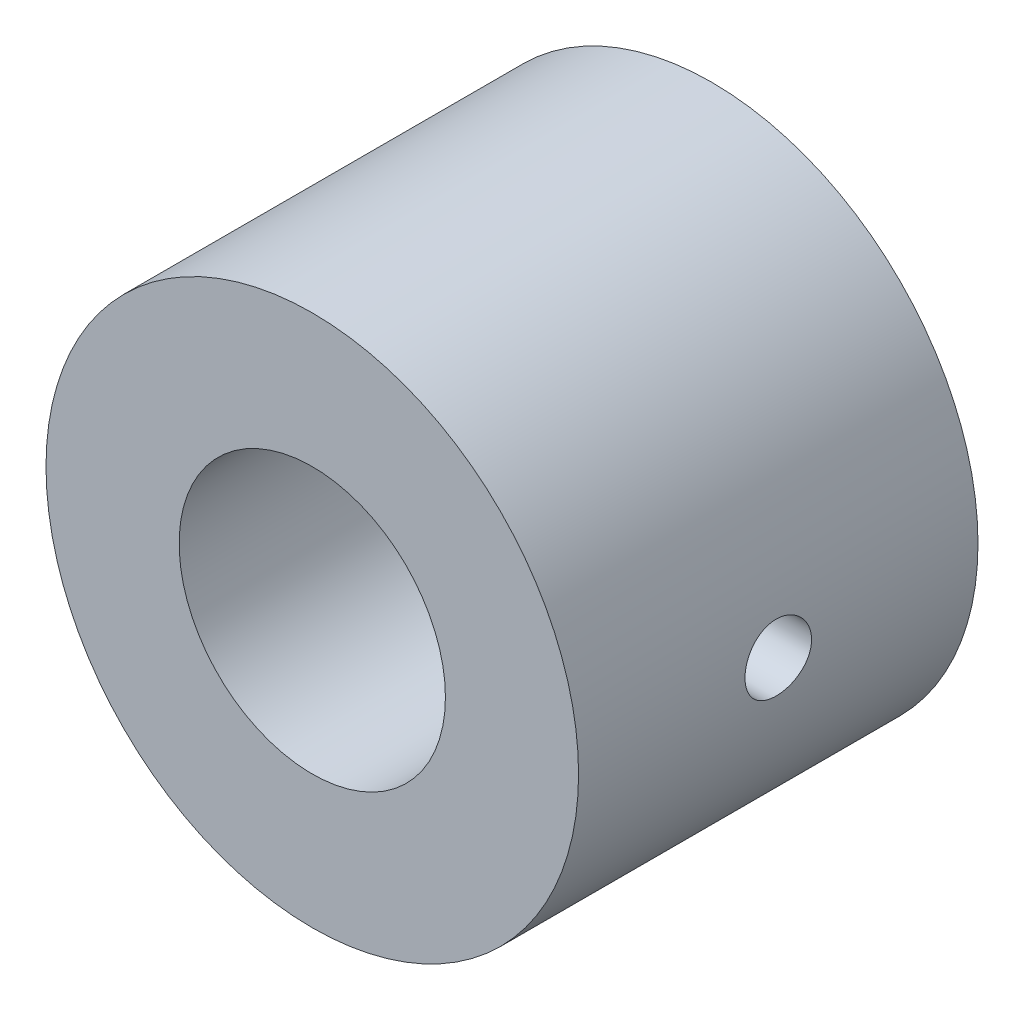
ISO-10303-21;
HEADER;
FILE_DESCRIPTION(('STEP AP214'),'2;1');
FILE_NAME('part.step','',(''),(''),'','','');
FILE_SCHEMA(('AUTOMOTIVE_DESIGN { 1 0 10303 214 1 1 1 1 }'));
ENDSEC;
DATA;
#1=APPLICATION_CONTEXT('core data for automotive mechanical design processes');
#2=APPLICATION_PROTOCOL_DEFINITION('international standard','automotive_design',2000,#1);
#3=PRODUCT_CONTEXT('',#1,'mechanical');
#4=PRODUCT('Part','Part','',(#3));
#5=PRODUCT_RELATED_PRODUCT_CATEGORY('part','',(#4));
#6=PRODUCT_DEFINITION_FORMATION('','',#4);
#7=PRODUCT_DEFINITION_CONTEXT('part definition',#1,'design');
#8=PRODUCT_DEFINITION('design','',#6,#7);
#9=PRODUCT_DEFINITION_SHAPE('','',#8);
#10=(LENGTH_UNIT() NAMED_UNIT(*) SI_UNIT(.MILLI.,.METRE.));
#11=(NAMED_UNIT(*) PLANE_ANGLE_UNIT() SI_UNIT($,.RADIAN.));
#12=(NAMED_UNIT(*) SI_UNIT($,.STERADIAN.) SOLID_ANGLE_UNIT());
#13=UNCERTAINTY_MEASURE_WITH_UNIT(LENGTH_MEASURE(1.E-05),#10,'distance_accuracy_value','');
#14=(GEOMETRIC_REPRESENTATION_CONTEXT(3) GLOBAL_UNCERTAINTY_ASSIGNED_CONTEXT((#13)) GLOBAL_UNIT_ASSIGNED_CONTEXT((#10,
#11,#12)) REPRESENTATION_CONTEXT('',''));
#15=CARTESIAN_POINT('',(0.,0.,0.));
#16=DIRECTION('',(0.,0.,1.));
#17=DIRECTION('',(1.,0.,0.));
#18=AXIS2_PLACEMENT_3D('',#15,#16,#17);
#19=CARTESIAN_POINT('',(0.,0.,15.));
#20=DIRECTION('',(0.,0.,1.));
#21=DIRECTION('',(1.,0.,0.));
#22=AXIS2_PLACEMENT_3D('',#19,#20,#21);
#23=PLANE('',#22);
#24=CARTESIAN_POINT('',(0.,0.,15.));
#25=DIRECTION('',(0.,0.,1.));
#26=DIRECTION('',(1.,0.,0.));
#27=AXIS2_PLACEMENT_3D('',#24,#25,#26);
#28=CIRCLE('',#27,10.);
#29=CARTESIAN_POINT('',(10.,0.,15.));
#30=VERTEX_POINT('',#29);
#31=EDGE_CURVE('E50',#30,#30,#28,.T.);
#32=ORIENTED_EDGE('',*,*,#31,.T.);
#33=EDGE_LOOP('',(#32));
#34=FACE_BOUND('',#33,.T.);
#35=CARTESIAN_POINT('',(0.,0.,15.));
#36=DIRECTION('',(0.,0.,1.));
#37=DIRECTION('',(1.,0.,0.));
#38=AXIS2_PLACEMENT_3D('',#35,#36,#37);
#39=CIRCLE('',#38,5.);
#40=CARTESIAN_POINT('',(5.,0.,15.));
#41=VERTEX_POINT('',#40);
#42=EDGE_CURVE('E82',#41,#41,#39,.T.);
#43=ORIENTED_EDGE('',*,*,#42,.F.);
#44=EDGE_LOOP('',(#43));
#45=FACE_BOUND('',#44,.T.);
#46=ADVANCED_FACE('F35',(#34,#45),#23,.T.);
#47=CARTESIAN_POINT('',(0.,0.,0.));
#48=DIRECTION('',(0.,0.,1.));
#49=DIRECTION('',(1.,0.,0.));
#50=AXIS2_PLACEMENT_3D('',#47,#48,#49);
#51=PLANE('',#50);
#52=CARTESIAN_POINT('',(0.,0.,0.));
#53=DIRECTION('',(0.,0.,1.));
#54=DIRECTION('',(1.,0.,0.));
#55=AXIS2_PLACEMENT_3D('',#52,#53,#54);
#56=CIRCLE('',#55,10.);
#57=CARTESIAN_POINT('',(10.,0.,0.));
#58=VERTEX_POINT('',#57);
#59=EDGE_CURVE('E54',#58,#58,#56,.T.);
#60=ORIENTED_EDGE('',*,*,#59,.F.);
#61=EDGE_LOOP('',(#60));
#62=FACE_BOUND('',#61,.T.);
#63=CARTESIAN_POINT('',(0.,0.,0.));
#64=DIRECTION('',(0.,0.,1.));
#65=DIRECTION('',(1.,0.,0.));
#66=AXIS2_PLACEMENT_3D('',#63,#64,#65);
#67=CIRCLE('',#66,5.);
#68=CARTESIAN_POINT('',(5.,0.,0.));
#69=VERTEX_POINT('',#68);
#70=EDGE_CURVE('E78',#69,#69,#67,.T.);
#71=ORIENTED_EDGE('',*,*,#70,.T.);
#72=EDGE_LOOP('',(#71));
#73=FACE_BOUND('',#72,.T.);
#74=ADVANCED_FACE('F88',(#62,#73),#51,.F.);
#75=CARTESIAN_POINT('',(0.,0.,15.));
#76=DIRECTION('',(0.,0.,-1.));
#77=DIRECTION('',(-1.,0.,0.));
#78=AXIS2_PLACEMENT_3D('',#75,#76,#77);
#79=CYLINDRICAL_SURFACE('',#78,10.);
#80=CARTESIAN_POINT('',(-10.,0.,8.74999999999999));
#81=CARTESIAN_POINT('',(-9.99999902448215,-0.0699205477778801,8.74999702953213));
#82=CARTESIAN_POINT('',(-9.99925892277451,-0.139884787151372,8.74411356041534));
#83=CARTESIAN_POINT('',(-9.9963777005568,-0.277866401044874,8.72073612271459));
#84=CARTESIAN_POINT('',(-9.99423511720715,-0.345881665311869,8.70323003103829));
#85=CARTESIAN_POINT('',(-9.98879030522203,-0.477947787406522,8.65713117804295));
#86=CARTESIAN_POINT('',(-9.98548885727771,-0.542001280073064,8.62854587909506));
#87=CARTESIAN_POINT('',(-9.97809350439049,-0.664389737446512,8.56111635801509));
#88=CARTESIAN_POINT('',(-9.97399973542058,-0.722725680778178,8.52227389573463));
#89=CARTESIAN_POINT('',(-9.96545160653163,-0.83235640846565,8.43520402508019));
#90=CARTESIAN_POINT('',(-9.96099557346209,-0.883615182468554,8.38693143532687));
#91=CARTESIAN_POINT('',(-9.95223863004875,-0.977326396778737,8.28246858823167));
#92=CARTESIAN_POINT('',(-9.94793772762134,-1.01977838819612,8.22627792754337));
#93=CARTESIAN_POINT('',(-9.93996152809793,-1.09480508064196,8.10734001121716));
#94=CARTESIAN_POINT('',(-9.93628838588956,-1.12734604797052,8.04457131921602));
#95=CARTESIAN_POINT('',(-9.93000564228841,-1.18141153828755,7.91440647402632));
#96=CARTESIAN_POINT('',(-9.92739600056568,-1.2029364790326,7.84701049642649));
#97=CARTESIAN_POINT('',(-9.92355169801807,-1.23424949001237,7.70987790220661));
#98=CARTESIAN_POINT('',(-9.92230991718372,-1.24409835736584,7.6401553711479));
#99=CARTESIAN_POINT('',(-9.92132014071396,-1.2519677747786,7.50003686826408));
#100=CARTESIAN_POINT('',(-9.92157208500754,-1.2499888005012,7.42964092363435));
#101=CARTESIAN_POINT('',(-9.92353477684876,-1.23430861822394,7.29059758637561));
#102=CARTESIAN_POINT('',(-9.92523718980165,-1.22067438149234,7.22194250689987));
#103=CARTESIAN_POINT('',(-9.92989599878815,-1.18217519159101,7.08790248939051));
#104=CARTESIAN_POINT('',(-9.93285242022862,-1.15731001087594,7.02251761764298));
#105=CARTESIAN_POINT('',(-9.93969557932326,-1.09698277995581,6.89666600048916));
#106=CARTESIAN_POINT('',(-9.94358486605722,-1.06149162685381,6.83621334987551));
#107=CARTESIAN_POINT('',(-9.95185355715299,-0.980940734728449,6.72209665279338));
#108=CARTESIAN_POINT('',(-9.95623298392831,-0.935880558040379,6.66843291701317));
#109=CARTESIAN_POINT('',(-9.96502554945212,-0.837099555376882,6.56902864463864));
#110=CARTESIAN_POINT('',(-9.96943871193445,-0.783321003919999,6.52334545411702));
#111=CARTESIAN_POINT('',(-9.97777316277926,-0.668828584556955,6.44164555998474));
#112=CARTESIAN_POINT('',(-9.98169445000753,-0.60811470065912,6.40562887866401));
#113=CARTESIAN_POINT('',(-9.9886057610929,-0.481430835681736,6.34428433976805));
#114=CARTESIAN_POINT('',(-9.99159547200768,-0.415459097668854,6.3189600730594));
#115=CARTESIAN_POINT('',(-9.99630392890031,-0.280153970215525,6.27976475323838));
#116=CARTESIAN_POINT('',(-9.99802273437935,-0.210820738315331,6.26589316393149));
#117=CARTESIAN_POINT('',(-9.9999879820538,-0.0712565819567478,6.25007128786974));
#118=CARTESIAN_POINT('',(-10.0002441807132,-0.00103474509930343,6.24804200381798));
#119=CARTESIAN_POINT('',(-9.99928169002715,0.138748018248747,6.25575386702799));
#120=CARTESIAN_POINT('',(-9.99806303209106,0.208308958782351,6.26549476362581));
#121=CARTESIAN_POINT('',(-9.99429384378346,0.344562253860758,6.2964048543872));
#122=CARTESIAN_POINT('',(-9.99174770406934,0.411263285212349,6.31753638170133));
#123=CARTESIAN_POINT('',(-9.98560861550098,0.540174827429198,6.37058872595647));
#124=CARTESIAN_POINT('',(-9.98201563110312,0.602385185732652,6.40250990924572));
#125=CARTESIAN_POINT('',(-9.97415911455056,0.720902260343707,6.47642656875374));
#126=CARTESIAN_POINT('',(-9.96989222021254,0.777176879971903,6.51847314490283));
#127=CARTESIAN_POINT('',(-9.96117571162828,0.881898494813151,6.61137474876711));
#128=CARTESIAN_POINT('',(-9.95672609013449,0.93034517916842,6.6622301261255));
#129=CARTESIAN_POINT('',(-9.94811552731292,1.018315979409,6.77165370837858));
#130=CARTESIAN_POINT('',(-9.94395637360664,1.05778773028396,6.8302641731552));
#131=CARTESIAN_POINT('',(-9.93642705518574,1.12632644472174,6.95332912242736));
#132=CARTESIAN_POINT('',(-9.93305687465514,1.15539361686417,7.01778348973826));
#133=CARTESIAN_POINT('',(-9.92749925196498,1.20221328943326,7.15053765957381));
#134=CARTESIAN_POINT('',(-9.92530872592394,1.21999531372854,7.21882691502399));
#135=CARTESIAN_POINT('',(-9.92234957953728,1.24383499693391,7.35745124189033));
#136=CARTESIAN_POINT('',(-9.92158089304389,1.24989320126787,7.4277862179795));
#137=CARTESIAN_POINT('',(-9.92155438491228,1.25010326804241,7.56798446460234));
#138=CARTESIAN_POINT('',(-9.92228612375977,1.24433739884962,7.63784762416594));
#139=CARTESIAN_POINT('',(-9.92515557268601,1.22123720242465,7.77560356467254));
#140=CARTESIAN_POINT('',(-9.92729328291541,1.20390287395287,7.84349634540439));
#141=CARTESIAN_POINT('',(-9.93273057887275,1.15818353684482,7.97537347838319));
#142=CARTESIAN_POINT('',(-9.93602974796392,1.12980249048546,8.0393592225109));
#143=CARTESIAN_POINT('',(-9.9434189162241,1.06280345107514,8.16167332702415));
#144=CARTESIAN_POINT('',(-9.94750892530207,1.02418532975478,8.22000161650991));
#145=CARTESIAN_POINT('',(-9.95605302376117,0.93750316563291,8.32976561267023));
#146=CARTESIAN_POINT('',(-9.96050936042016,0.88937781288747,8.38115273047748));
#147=CARTESIAN_POINT('',(-9.9692641579645,0.785175113484183,8.47515341258398));
#148=CARTESIAN_POINT('',(-9.97356258137795,0.729095894570776,8.51776490538715));
#149=CARTESIAN_POINT('',(-9.98153528293373,0.610332810427099,8.59314267855264));
#150=CARTESIAN_POINT('',(-9.98520712539151,0.54762463979808,8.62587090294962));
#151=CARTESIAN_POINT('',(-9.99148824538363,0.417591451150637,8.68028562145813));
#152=CARTESIAN_POINT('',(-9.99409867684788,0.350271540435115,8.70198411317672));
#153=CARTESIAN_POINT('',(-9.99733360163873,0.23550288598396,8.72852966908564));
#154=CARTESIAN_POINT('',(-9.99832862947727,0.188777831758459,8.73656947099102));
#155=CARTESIAN_POINT('',(-9.99966215664594,0.094708531606217,8.7473056228466));
#156=CARTESIAN_POINT('',(-10.0000006608173,0.0473642902480134,8.75000201219964));
#157=CARTESIAN_POINT('',(-10.,0.,8.74999999999999));
#158=B_SPLINE_CURVE_WITH_KNOTS('',3,(#80,#81,#82,#83,#84,#85,#86,#87,#88,#89,#90,#91,#92,#93,
#94,#95,#96,#97,#98,#99,#100,#101,#102,#103,#104,#105,#106,#107,#108,#109,#110,#111,#112,#113,
#114,#115,#116,#117,#118,#119,#120,#121,#122,#123,#124,#125,#126,#127,#128,#129,#130,#131,#132,
#133,#134,#135,#136,#137,#138,#139,#140,#141,#142,#143,#144,#145,#146,#147,#148,#149,#150,#151,
#152,#153,#154,#155,#156,#157),.UNSPECIFIED.,.T.,.F.,(4,2,2,2,2,2,2,2,2,2,2,2,2,2,2,2,2,2,2,2,2,
2,2,2,2,2,2,2,2,2,2,2,2,2,2,2,2,2,4),(0.,0.209588636388122,0.41939623047171,0.62906275409088,
0.838693327955358,1.0493540660092,1.26002553900004,1.47140625159433,1.68277894748402,
1.89304612643158,2.1033048494233,2.31236348220844,2.52142635083118,2.73106713142764,
2.94071750256816,3.15181739068205,3.36291776556554,3.57408897865799,3.78525030451887,
3.99500139695957,4.2047480225096,4.41380526946694,4.62286961539469,4.83301201464207,
5.04316275687539,5.25450985753782,5.46585272110764,5.67664037140457,5.88741821505306,
6.09673450601102,6.30605081939768,6.51529212353238,6.72453604956126,6.93517618845909,
7.14586599235,7.3573570151842,7.5686174934201,7.71059421593807,7.85256989150211),.UNSPECIFIED.);
#159=CARTESIAN_POINT('',(-10.,0.,8.74999999999999));
#160=VERTEX_POINT('',#159);
#161=EDGE_CURVE('E10',#160,#160,#158,.T.);
#162=ORIENTED_EDGE('',*,*,#161,.T.);
#163=EDGE_LOOP('',(#162));
#164=FACE_BOUND('',#163,.T.);
#165=CARTESIAN_POINT('',(10.,0.,6.25));
#166=CARTESIAN_POINT('',(9.99999902448214,-0.0699205477778806,6.25000297046786));
#167=CARTESIAN_POINT('',(9.99925892277451,-0.139884787151373,6.25588643958464));
#168=CARTESIAN_POINT('',(9.9963777005568,-0.277866401044876,6.2792638772854));
#169=CARTESIAN_POINT('',(9.99423511720715,-0.345881665311872,6.2967699689617));
#170=CARTESIAN_POINT('',(9.98879030522203,-0.477947787406526,6.34286882195704));
#171=CARTESIAN_POINT('',(9.98548885727771,-0.542001280073068,6.37145412090493));
#172=CARTESIAN_POINT('',(9.97809350439049,-0.664389737446517,6.4388836419849));
#173=CARTESIAN_POINT('',(9.97399973542058,-0.722725680778185,6.47772610426536));
#174=CARTESIAN_POINT('',(9.96545160653163,-0.832356408465658,6.5647959749198));
#175=CARTESIAN_POINT('',(9.96099557346208,-0.883615182468563,6.61306856467312));
#176=CARTESIAN_POINT('',(9.95223863004875,-0.977326396778746,6.71753141176832));
#177=CARTESIAN_POINT('',(9.94793772762134,-1.01977838819612,6.77372207245662));
#178=CARTESIAN_POINT('',(9.93996152809792,-1.09480508064197,6.89265998878283));
#179=CARTESIAN_POINT('',(9.93628838588955,-1.12734604797053,6.95542868078397));
#180=CARTESIAN_POINT('',(9.93000564228841,-1.18141153828756,7.08559352597368));
#181=CARTESIAN_POINT('',(9.92739600056568,-1.20293647903261,7.15298950357351));
#182=CARTESIAN_POINT('',(9.92355169801807,-1.23424949001238,7.29012209779338));
#183=CARTESIAN_POINT('',(9.92230991718372,-1.24409835736585,7.3598446288521));
#184=CARTESIAN_POINT('',(9.92132014071396,-1.25196777477861,7.49996313173592));
#185=CARTESIAN_POINT('',(9.92157208500754,-1.24998880050121,7.57035907636565));
#186=CARTESIAN_POINT('',(9.92353477684876,-1.23430861822395,7.70940241362439));
#187=CARTESIAN_POINT('',(9.92523718980165,-1.22067438149235,7.77805749310013));
#188=CARTESIAN_POINT('',(9.92989599878815,-1.18217519159102,7.91209751060949));
#189=CARTESIAN_POINT('',(9.93285242022862,-1.15731001087595,7.97748238235702));
#190=CARTESIAN_POINT('',(9.93969557932325,-1.09698277995582,8.10333399951084));
#191=CARTESIAN_POINT('',(9.94358486605722,-1.06149162685382,8.16378665012449));
#192=CARTESIAN_POINT('',(9.95185355715299,-0.980940734728458,8.27790334720662));
#193=CARTESIAN_POINT('',(9.95623298392831,-0.935880558040387,8.33156708298684));
#194=CARTESIAN_POINT('',(9.96502554945212,-0.837099555376889,8.43097135536137));
#195=CARTESIAN_POINT('',(9.96943871193445,-0.783321003920005,8.47665454588299));
#196=CARTESIAN_POINT('',(9.97777316277926,-0.66882858455696,8.55835444001527));
#197=CARTESIAN_POINT('',(9.98169445000753,-0.608114700659125,8.594371121336));
#198=CARTESIAN_POINT('',(9.9886057610929,-0.48143083568174,8.65571566023196));
#199=CARTESIAN_POINT('',(9.99159547200768,-0.415459097668858,8.68103992694061));
#200=CARTESIAN_POINT('',(9.99630392890031,-0.280153970215528,8.72023524676163));
#201=CARTESIAN_POINT('',(9.99802273437935,-0.210820738315333,8.73410683606852));
#202=CARTESIAN_POINT('',(9.9999879820538,-0.0712565819567482,8.74992871213028));
#203=CARTESIAN_POINT('',(10.0002441807132,-0.00103474509930298,8.75195799618203));
#204=CARTESIAN_POINT('',(9.99928169002715,0.138748018248749,8.74424613297202));
#205=CARTESIAN_POINT('',(9.99806303209106,0.208308958782354,8.7345052363742));
#206=CARTESIAN_POINT('',(9.99429384378346,0.344562253860761,8.70359514561281));
#207=CARTESIAN_POINT('',(9.99174770406934,0.411263285212352,8.68246361829868));
#208=CARTESIAN_POINT('',(9.98560861550098,0.540174827429203,8.62941127404354));
#209=CARTESIAN_POINT('',(9.98201563110312,0.602385185732657,8.59749009075428));
#210=CARTESIAN_POINT('',(9.97415911455056,0.720902260343713,8.52357343124627));
#211=CARTESIAN_POINT('',(9.96989222021254,0.777176879971909,8.48152685509718));
#212=CARTESIAN_POINT('',(9.96117571162828,0.881898494813159,8.3886252512329));
#213=CARTESIAN_POINT('',(9.95672609013449,0.930345179168429,8.3377698738745));
#214=CARTESIAN_POINT('',(9.94811552731292,1.01831597940901,8.22834629162143));
#215=CARTESIAN_POINT('',(9.94395637360663,1.05778773028397,8.1697358268448));
#216=CARTESIAN_POINT('',(9.93642705518574,1.12632644472175,8.04667087757264));
#217=CARTESIAN_POINT('',(9.93305687465513,1.15539361686418,7.98221651026174));
#218=CARTESIAN_POINT('',(9.92749925196498,1.20221328943327,7.84946234042619));
#219=CARTESIAN_POINT('',(9.92530872592394,1.21999531372855,7.78117308497601));
#220=CARTESIAN_POINT('',(9.92234957953727,1.24383499693392,7.64254875810967));
#221=CARTESIAN_POINT('',(9.92158089304388,1.24989320126788,7.5722137820205));
#222=CARTESIAN_POINT('',(9.92155438491228,1.25010326804242,7.43201553539766));
#223=CARTESIAN_POINT('',(9.92228612375977,1.24433739884964,7.36215237583405));
#224=CARTESIAN_POINT('',(9.92515557268601,1.22123720242466,7.22439643532746));
#225=CARTESIAN_POINT('',(9.92729328291541,1.20390287395288,7.1565036545956));
#226=CARTESIAN_POINT('',(9.93273057887275,1.15818353684483,7.0246265216168));
#227=CARTESIAN_POINT('',(9.93602974796392,1.12980249048547,6.96064077748909));
#228=CARTESIAN_POINT('',(9.94341891622409,1.06280345107515,6.83832667297584));
#229=CARTESIAN_POINT('',(9.94750892530207,1.02418532975479,6.77999838349009));
#230=CARTESIAN_POINT('',(9.95605302376117,0.937503165632918,6.67023438732976));
#231=CARTESIAN_POINT('',(9.96050936042016,0.889377812887478,6.61884726952251));
#232=CARTESIAN_POINT('',(9.9692641579645,0.78517511348419,6.52484658741601));
#233=CARTESIAN_POINT('',(9.97356258137795,0.729095894570782,6.48223509461284));
#234=CARTESIAN_POINT('',(9.98153528293373,0.610332810427103,6.40685732144735));
#235=CARTESIAN_POINT('',(9.9852071253915,0.547624639798083,6.37412909705037));
#236=CARTESIAN_POINT('',(9.99148824538362,0.417591451150639,6.31971437854186));
#237=CARTESIAN_POINT('',(9.99409867684788,0.350271540435117,6.29801588682327));
#238=CARTESIAN_POINT('',(9.99733360163873,0.235502885983961,6.27147033091435));
#239=CARTESIAN_POINT('',(9.99832862947727,0.188777831758459,6.26343052900897));
#240=CARTESIAN_POINT('',(9.99966215664594,0.0947085316062167,6.25269437715339));
#241=CARTESIAN_POINT('',(10.0000006608173,0.0473642902480133,6.24999798780035));
#242=CARTESIAN_POINT('',(10.,0.,6.25));
#243=B_SPLINE_CURVE_WITH_KNOTS('',3,(#165,#166,#167,#168,#169,#170,#171,#172,#173,#174,#175,
#176,#177,#178,#179,#180,#181,#182,#183,#184,#185,#186,#187,#188,#189,#190,#191,#192,#193,#194,
#195,#196,#197,#198,#199,#200,#201,#202,#203,#204,#205,#206,#207,#208,#209,#210,#211,#212,#213,
#214,#215,#216,#217,#218,#219,#220,#221,#222,#223,#224,#225,#226,#227,#228,#229,#230,#231,#232,
#233,#234,#235,#236,#237,#238,#239,#240,#241,#242),.UNSPECIFIED.,.T.,.F.,(4,2,2,2,2,2,2,2,2,2,2,
2,2,2,2,2,2,2,2,2,2,2,2,2,2,2,2,2,2,2,2,2,2,2,2,2,2,2,4),(0.,0.209588636388123,
0.419396230471713,0.629062754090884,0.838693327955365,1.04935406600921,1.26002553900005,
1.47140625159435,1.68277894748403,1.8930461264316,2.10330484942332,2.31236348220846,
2.5214263508312,2.73106713142767,2.94071750256819,3.15181739068208,3.36291776556557,
3.57408897865802,3.7852503045189,3.9950013969596,4.20474802250964,4.41380526946698,
4.62286961539474,4.83301201464211,5.04316275687544,5.25450985753786,5.46585272110769,
5.67664037140462,5.88741821505311,6.09673450601107,6.30605081939774,6.51529212353243,
6.72453604956131,6.93517618845915,7.14586599235006,7.35735701518426,7.56861749342016,
7.71059421593814,7.85256989150218),.UNSPECIFIED.);
#244=CARTESIAN_POINT('',(10.,0.,6.25));
#245=VERTEX_POINT('',#244);
#246=EDGE_CURVE('E46',#245,#245,#243,.T.);
#247=ORIENTED_EDGE('',*,*,#246,.T.);
#248=EDGE_LOOP('',(#247));
#249=FACE_BOUND('',#248,.T.);
#250=ORIENTED_EDGE('',*,*,#31,.F.);
#251=EDGE_LOOP('',(#250));
#252=FACE_BOUND('',#251,.T.);
#253=ORIENTED_EDGE('',*,*,#59,.T.);
#254=EDGE_LOOP('',(#253));
#255=FACE_BOUND('',#254,.T.);
#256=ADVANCED_FACE('F37',(#164,#249,#252,#255),#79,.T.);
#257=CARTESIAN_POINT('',(0.,0.,15.));
#258=DIRECTION('',(0.,0.,-1.));
#259=DIRECTION('',(-1.,0.,0.));
#260=AXIS2_PLACEMENT_3D('',#257,#258,#259);
#261=CYLINDRICAL_SURFACE('',#260,5.);
#262=CARTESIAN_POINT('',(-5.,0.,8.74999999999999));
#263=CARTESIAN_POINT('',(-4.99999883223344,-0.0690634072247753,8.74999806188485));
#264=CARTESIAN_POINT('',(-4.99855481776524,-0.138148464858968,8.74425704102183));
#265=CARTESIAN_POINT('',(-4.99293428191577,-0.274338603142108,8.72147904057748));
#266=CARTESIAN_POINT('',(-4.98875621183307,-0.341442539058946,8.70443565871845));
#267=CARTESIAN_POINT('',(-4.97813021943367,-0.471684060152143,8.65963395544825));
#268=CARTESIAN_POINT('',(-4.97168502368406,-0.534826302858331,8.63188850107059));
#269=CARTESIAN_POINT('',(-4.95721119839661,-0.655560109920349,8.56651550829596));
#270=CARTESIAN_POINT('',(-4.94918251545042,-0.713151486957293,8.52888763656754));
#271=CARTESIAN_POINT('',(-4.93222844659835,-0.822334939417425,8.44399934195481));
#272=CARTESIAN_POINT('',(-4.92328922623778,-0.873796408384218,8.39657368753401));
#273=CARTESIAN_POINT('',(-4.90561350097942,-0.968124106002744,8.29378982924256));
#274=CARTESIAN_POINT('',(-4.89687701906957,-1.01098936412427,8.23843073087791));
#275=CARTESIAN_POINT('',(-4.88045646416426,-1.08752211899918,8.12033731105213));
#276=CARTESIAN_POINT('',(-4.87278995392171,-1.12104351327112,8.05750564099132));
#277=CARTESIAN_POINT('',(-4.8595791234352,-1.1769974237921,7.92687632361803));
#278=CARTESIAN_POINT('',(-4.85403446393991,-1.1994317128661,7.85907947222853));
#279=CARTESIAN_POINT('',(-4.8458373059796,-1.23212903067023,7.7218804181646));
#280=CARTESIAN_POINT('',(-4.84312909229522,-1.24262689027777,7.65253758662516));
#281=CARTESIAN_POINT('',(-4.84074468781451,-1.25188481255653,7.51302619248835));
#282=CARTESIAN_POINT('',(-4.8410680037387,-1.2506467848483,7.44285776608449));
#283=CARTESIAN_POINT('',(-4.84466004580516,-1.23665543719939,7.3054868268796));
#284=CARTESIAN_POINT('',(-4.84785719168233,-1.22418195015875,7.23825364877909));
#285=CARTESIAN_POINT('',(-4.85672258063737,-1.18852015575258,7.10686579090726));
#286=CARTESIAN_POINT('',(-4.86239099975581,-1.16533108505784,7.04271133080918));
#287=CARTESIAN_POINT('',(-4.87562594920156,-1.10865789828095,6.91855165312328));
#288=CARTESIAN_POINT('',(-4.88321106224518,-1.07507222269408,6.85859485684205));
#289=CARTESIAN_POINT('',(-4.89941425705322,-0.998630230012452,6.74506774186931));
#290=CARTESIAN_POINT('',(-4.90803251945613,-0.955772290674023,6.69149854327729));
#291=CARTESIAN_POINT('',(-4.92563233783151,-0.860552853901006,6.59066365358801));
#292=CARTESIAN_POINT('',(-4.93461724564977,-0.807955215138208,6.54362125828222));
#293=CARTESIAN_POINT('',(-4.95171637982322,-0.695509931253076,6.45898229794676));
#294=CARTESIAN_POINT('',(-4.95983057957846,-0.635662064756613,6.42138602144704));
#295=CARTESIAN_POINT('',(-4.97431443411819,-0.510096573901154,6.35662451147969));
#296=CARTESIAN_POINT('',(-4.98067800106438,-0.444359494340515,6.32949554978799));
#297=CARTESIAN_POINT('',(-4.99089930826182,-0.309063340119065,6.28673557857537));
#298=CARTESIAN_POINT('',(-4.99475752782734,-0.239504999292067,6.27110236965156));
#299=CARTESIAN_POINT('',(-4.99946249392812,-0.10044997532502,6.25211869536765));
#300=CARTESIAN_POINT('',(-5.00038377923566,-0.03099726665684,6.24846414493726));
#301=CARTESIAN_POINT('',(-4.99932337345376,0.107527395667924,6.25270750171292));
#302=CARTESIAN_POINT('',(-4.99734194368206,0.176599383037162,6.26060436899929));
#303=CARTESIAN_POINT('',(-4.99074650939464,0.311345223980408,6.28747575699283));
#304=CARTESIAN_POINT('',(-4.98617195154843,0.377054265807293,6.30628438623083));
#305=CARTESIAN_POINT('',(-4.97490588861779,0.504381077043756,6.35425590335705));
#306=CARTESIAN_POINT('',(-4.9682141697491,0.565998432527191,6.38341983692765));
#307=CARTESIAN_POINT('',(-4.95327756605259,0.684602612024867,6.45186344072895));
#308=CARTESIAN_POINT('',(-4.94500722805777,0.741487868196519,6.49131342699731));
#309=CARTESIAN_POINT('',(-4.92787090989516,0.847938844702698,6.57899159066415));
#310=CARTESIAN_POINT('',(-4.91900482709754,0.897503299144165,6.6272212830141));
#311=CARTESIAN_POINT('',(-4.9014079746731,0.989158806727267,6.73250163403706));
#312=CARTESIAN_POINT('',(-4.89268586822735,1.03103655635168,6.78973975250203));
#313=CARTESIAN_POINT('',(-4.87660731981033,1.10459229917724,6.91061052872144));
#314=CARTESIAN_POINT('',(-4.86925081722522,1.1362707451316,6.97424290246647));
#315=CARTESIAN_POINT('',(-4.85681745612222,1.18829285050773,7.10575476867757));
#316=CARTESIAN_POINT('',(-4.85172712743255,1.20870366387838,7.17360635695335));
#317=CARTESIAN_POINT('',(-4.84438953408487,1.23778804996147,7.31192469824093));
#318=CARTESIAN_POINT('',(-4.84214164766614,1.24646418956554,7.38239087586041));
#319=CARTESIAN_POINT('',(-4.84079084336631,1.25169882527832,7.52176751987934));
#320=CARTESIAN_POINT('',(-4.8415994394022,1.24859824815009,7.59066452927061));
#321=CARTESIAN_POINT('',(-4.8460659083987,1.23114773192738,7.72691990722332));
#322=CARTESIAN_POINT('',(-4.84972372409881,1.21679801890563,7.79427830667804));
#323=CARTESIAN_POINT('',(-4.85942717235603,1.17744276620232,7.92517371588784));
#324=CARTESIAN_POINT('',(-4.86545846030258,1.15250117056697,7.98873108770017));
#325=CARTESIAN_POINT('',(-4.87923129770691,1.09272076133755,8.11080448559474));
#326=CARTESIAN_POINT('',(-4.88697308433978,1.05788057502848,8.16931981098909));
#327=CARTESIAN_POINT('',(-4.90354695219594,0.97822312386427,8.28129552416834));
#328=CARTESIAN_POINT('',(-4.91240220693131,0.933169302426869,8.33458422785329));
#329=CARTESIAN_POINT('',(-4.93006689371905,0.834824475991437,8.43295587066283));
#330=CARTESIAN_POINT('',(-4.93887631439217,0.781531517717614,8.47803685842747));
#331=CARTESIAN_POINT('',(-4.95564713039719,0.667056322252151,8.55950942380383));
#332=CARTESIAN_POINT('',(-4.9635902780489,0.605748685263648,8.5957288447263));
#333=CARTESIAN_POINT('',(-4.97754104145932,0.477721716258724,8.65728955245043));
#334=CARTESIAN_POINT('',(-4.98355004333151,0.411006302863944,8.68263863387377));
#335=CARTESIAN_POINT('',(-4.99206716304618,0.287008544369556,8.7179765252747));
#336=CARTESIAN_POINT('',(-4.99502154210576,0.230316809090054,8.72995936921118));
#337=CARTESIAN_POINT('',(-4.99898837693291,0.115755059613568,8.74597161968494));
#338=CARTESIAN_POINT('',(-5.00000097875745,0.0578851343688461,8.75000162442107));
#339=CARTESIAN_POINT('',(-5.,0.,8.74999999999999));
#340=B_SPLINE_CURVE_WITH_KNOTS('',3,(#262,#263,#264,#265,#266,#267,#268,#269,#270,#271,#272,
#273,#274,#275,#276,#277,#278,#279,#280,#281,#282,#283,#284,#285,#286,#287,#288,#289,#290,#291,
#292,#293,#294,#295,#296,#297,#298,#299,#300,#301,#302,#303,#304,#305,#306,#307,#308,#309,#310,
#311,#312,#313,#314,#315,#316,#317,#318,#319,#320,#321,#322,#323,#324,#325,#326,#327,#328,#329,
#330,#331,#332,#333,#334,#335,#336,#337,#338,#339),.UNSPECIFIED.,.T.,.F.,(4,2,2,2,2,2,2,2,2,2,2,
2,2,2,2,2,2,2,2,2,2,2,2,2,2,2,2,2,2,2,2,2,2,2,2,2,2,2,4),(0.,0.206978093726573,
0.414073531469913,0.620920751905083,0.827774950141099,1.03845362864281,1.24915607983384,
1.46298872954838,1.67678717641139,1.8863024591619,2.09578365093912,2.30018747505846,
2.50460586221696,2.7110877322823,2.91760575696799,3.13001250807513,3.34242574631869,
3.55556857507591,3.76867061407199,3.97631924124393,4.18394917593948,4.38850228761693,
4.59307606101904,4.80127989637789,5.00951969173344,5.22287091003725,5.43621265624585,
5.64826878845025,5.86027852710334,6.06619816998838,6.27211367463356,6.47680333799533,
6.68152140114078,6.89157980341585,7.10168808142008,7.31560154582983,7.52936136517784,
7.70285202451783,7.87632963369192),.UNSPECIFIED.);
#341=CARTESIAN_POINT('',(-5.,0.,8.74999999999999));
#342=VERTEX_POINT('',#341);
#343=EDGE_CURVE('E79',#342,#342,#340,.T.);
#344=ORIENTED_EDGE('',*,*,#343,.F.);
#345=EDGE_LOOP('',(#344));
#346=FACE_BOUND('',#345,.T.);
#347=CARTESIAN_POINT('',(5.,0.,6.25));
#348=CARTESIAN_POINT('',(4.99999883223344,-0.0690634072247758,6.25000193811513));
#349=CARTESIAN_POINT('',(4.99855481776524,-0.138148464858969,6.25574295897816));
#350=CARTESIAN_POINT('',(4.99293428191577,-0.27433860314211,6.2785209594225));
#351=CARTESIAN_POINT('',(4.98875621183307,-0.341442539058949,6.29556434128154));
#352=CARTESIAN_POINT('',(4.97813021943367,-0.471684060152147,6.34036604455174));
#353=CARTESIAN_POINT('',(4.97168502368406,-0.534826302858335,6.3681114989294));
#354=CARTESIAN_POINT('',(4.95721119839661,-0.655560109920355,6.43348449170403));
#355=CARTESIAN_POINT('',(4.94918251545042,-0.713151486957299,6.47111236343245));
#356=CARTESIAN_POINT('',(4.93222844659835,-0.822334939417432,6.55600065804518));
#357=CARTESIAN_POINT('',(4.92328922623778,-0.873796408384225,6.60342631246598));
#358=CARTESIAN_POINT('',(4.90561350097942,-0.968124106002752,6.70621017075743));
#359=CARTESIAN_POINT('',(4.89687701906957,-1.01098936412428,6.76156926912208));
#360=CARTESIAN_POINT('',(4.88045646416426,-1.08752211899919,6.87966268894786));
#361=CARTESIAN_POINT('',(4.87278995392171,-1.12104351327113,6.94249435900867));
#362=CARTESIAN_POINT('',(4.8595791234352,-1.1769974237921,7.07312367638197));
#363=CARTESIAN_POINT('',(4.85403446393991,-1.19943171286611,7.14092052777147));
#364=CARTESIAN_POINT('',(4.84583730597959,-1.23212903067024,7.2781195818354));
#365=CARTESIAN_POINT('',(4.84312909229522,-1.24262689027778,7.34746241337483));
#366=CARTESIAN_POINT('',(4.84074468781451,-1.25188481255654,7.48697380751165));
#367=CARTESIAN_POINT('',(4.8410680037387,-1.25064678484831,7.55714223391551));
#368=CARTESIAN_POINT('',(4.84466004580515,-1.2366554371994,7.6945131731204));
#369=CARTESIAN_POINT('',(4.84785719168233,-1.22418195015877,7.76174635122091));
#370=CARTESIAN_POINT('',(4.85672258063737,-1.18852015575259,7.89313420909274));
#371=CARTESIAN_POINT('',(4.86239099975581,-1.16533108505785,7.95728866919082));
#372=CARTESIAN_POINT('',(4.87562594920156,-1.10865789828096,8.08144834687672));
#373=CARTESIAN_POINT('',(4.88321106224518,-1.07507222269409,8.14140514315796));
#374=CARTESIAN_POINT('',(4.89941425705322,-0.998630230012461,8.2549322581307));
#375=CARTESIAN_POINT('',(4.90803251945613,-0.955772290674032,8.30850145672271));
#376=CARTESIAN_POINT('',(4.92563233783151,-0.860552853901015,8.409336346412));
#377=CARTESIAN_POINT('',(4.93461724564976,-0.807955215138216,8.45637874171779));
#378=CARTESIAN_POINT('',(4.95171637982322,-0.695509931253082,8.54101770205325));
#379=CARTESIAN_POINT('',(4.95983057957846,-0.635662064756619,8.57861397855297));
#380=CARTESIAN_POINT('',(4.97431443411819,-0.510096573901159,8.64337548852032));
#381=CARTESIAN_POINT('',(4.98067800106438,-0.444359494340518,8.67050445021202));
#382=CARTESIAN_POINT('',(4.99089930826182,-0.309063340119068,8.71326442142464));
#383=CARTESIAN_POINT('',(4.99475752782734,-0.239504999292069,8.72889763034845));
#384=CARTESIAN_POINT('',(4.99946249392812,-0.100449975325021,8.74788130463236));
#385=CARTESIAN_POINT('',(5.00038377923566,-0.0309972666568404,8.75153585506275));
#386=CARTESIAN_POINT('',(4.99932337345376,0.107527395667924,8.74729249828709));
#387=CARTESIAN_POINT('',(4.99734194368206,0.176599383037162,8.73939563100072));
#388=CARTESIAN_POINT('',(4.99074650939464,0.31134522398041,8.71252424300718));
#389=CARTESIAN_POINT('',(4.98617195154843,0.377054265807296,8.69371561376918));
#390=CARTESIAN_POINT('',(4.97490588861779,0.50438107704376,8.64574409664296));
#391=CARTESIAN_POINT('',(4.9682141697491,0.565998432527195,8.61658016307236));
#392=CARTESIAN_POINT('',(4.95327756605259,0.684602612024872,8.54813655927106));
#393=CARTESIAN_POINT('',(4.94500722805777,0.741487868196525,8.5086865730027));
#394=CARTESIAN_POINT('',(4.92787090989516,0.847938844702704,8.42100840933586));
#395=CARTESIAN_POINT('',(4.91900482709754,0.897503299144172,8.37277871698591));
#396=CARTESIAN_POINT('',(4.9014079746731,0.989158806727274,8.26749836596295));
#397=CARTESIAN_POINT('',(4.89268586822734,1.03103655635169,8.21026024749798));
#398=CARTESIAN_POINT('',(4.87660731981032,1.10459229917725,8.08938947127857));
#399=CARTESIAN_POINT('',(4.86925081722522,1.13627074513161,8.02575709753354));
#400=CARTESIAN_POINT('',(4.85681745612221,1.18829285050774,7.89424523132243));
#401=CARTESIAN_POINT('',(4.85172712743255,1.20870366387839,7.82639364304666));
#402=CARTESIAN_POINT('',(4.84438953408486,1.23778804996148,7.68807530175908));
#403=CARTESIAN_POINT('',(4.84214164766614,1.24646418956555,7.61760912413959));
#404=CARTESIAN_POINT('',(4.84079084336631,1.25169882527833,7.47823248012066));
#405=CARTESIAN_POINT('',(4.8415994394022,1.2485982481501,7.40933547072939));
#406=CARTESIAN_POINT('',(4.84606590839869,1.23114773192739,7.27308009277668));
#407=CARTESIAN_POINT('',(4.84972372409881,1.21679801890564,7.20572169332196));
#408=CARTESIAN_POINT('',(4.85942717235602,1.17744276620233,7.07482628411216));
#409=CARTESIAN_POINT('',(4.86545846030258,1.15250117056698,7.01126891229983));
#410=CARTESIAN_POINT('',(4.87923129770691,1.09272076133756,6.88919551440526));
#411=CARTESIAN_POINT('',(4.88697308433978,1.05788057502849,6.8306801890109));
#412=CARTESIAN_POINT('',(4.90354695219594,0.978223123864279,6.71870447583165));
#413=CARTESIAN_POINT('',(4.91240220693131,0.933169302426877,6.6654157721467));
#414=CARTESIAN_POINT('',(4.93006689371905,0.834824475991445,6.56704412933716));
#415=CARTESIAN_POINT('',(4.93887631439217,0.78153151771762,6.52196314157253));
#416=CARTESIAN_POINT('',(4.95564713039719,0.667056322252158,6.44049057619616));
#417=CARTESIAN_POINT('',(4.9635902780489,0.605748685263655,6.40427115527369));
#418=CARTESIAN_POINT('',(4.97754104145932,0.47772171625873,6.34271044754956));
#419=CARTESIAN_POINT('',(4.98355004333151,0.411006302863949,6.31736136612622));
#420=CARTESIAN_POINT('',(4.99206716304618,0.28700854436956,6.28202347472529));
#421=CARTESIAN_POINT('',(4.99502154210576,0.230316809090057,6.27004063078881));
#422=CARTESIAN_POINT('',(4.99898837693291,0.11575505961357,6.25402838031505));
#423=CARTESIAN_POINT('',(5.00000097875745,0.057885134368847,6.24999837557892));
#424=CARTESIAN_POINT('',(5.,0.,6.25));
#425=B_SPLINE_CURVE_WITH_KNOTS('',3,(#347,#348,#349,#350,#351,#352,#353,#354,#355,#356,#357,
#358,#359,#360,#361,#362,#363,#364,#365,#366,#367,#368,#369,#370,#371,#372,#373,#374,#375,#376,
#377,#378,#379,#380,#381,#382,#383,#384,#385,#386,#387,#388,#389,#390,#391,#392,#393,#394,#395,
#396,#397,#398,#399,#400,#401,#402,#403,#404,#405,#406,#407,#408,#409,#410,#411,#412,#413,#414,
#415,#416,#417,#418,#419,#420,#421,#422,#423,#424),.UNSPECIFIED.,.T.,.F.,(4,2,2,2,2,2,2,2,2,2,2,
2,2,2,2,2,2,2,2,2,2,2,2,2,2,2,2,2,2,2,2,2,2,2,2,2,2,2,4),(0.,0.206978093726574,
0.414073531469916,0.620920751905087,0.827774950141106,1.03845362864282,1.24915607983385,
1.46298872954839,1.6767871764114,1.88630245916192,2.09578365093914,2.30018747505848,
2.50460586221698,2.71108773228232,2.91760575696802,3.13001250807516,3.34242574631872,
3.55556857507595,3.76867061407202,3.97631924124396,4.18394917593952,4.38850228761697,
4.59307606101908,4.80127989637793,5.00951969173349,5.22287091003729,5.43621265624589,
5.6482687884503,5.86027852710339,6.06619816998843,6.27211367463361,6.47680333799539,
6.68152140114084,6.89157980341591,7.10168808142014,7.31560154582989,7.52936136517791,
7.7028520245179,7.87632963369199),.UNSPECIFIED.);
#426=CARTESIAN_POINT('',(5.,0.,6.25));
#427=VERTEX_POINT('',#426);
#428=EDGE_CURVE('E72',#427,#427,#425,.T.);
#429=ORIENTED_EDGE('',*,*,#428,.F.);
#430=EDGE_LOOP('',(#429));
#431=FACE_BOUND('',#430,.T.);
#432=ORIENTED_EDGE('',*,*,#42,.T.);
#433=EDGE_LOOP('',(#432));
#434=FACE_BOUND('',#433,.T.);
#435=ORIENTED_EDGE('',*,*,#70,.F.);
#436=EDGE_LOOP('',(#435));
#437=FACE_BOUND('',#436,.T.);
#438=ADVANCED_FACE('F65',(#346,#431,#434,#437),#261,.F.);
#439=CARTESIAN_POINT('',(10.,0.,7.5));
#440=DIRECTION('',(1.,0.,0.));
#441=DIRECTION('',(0.,0.,-1.));
#442=AXIS2_PLACEMENT_3D('',#439,#440,#441);
#443=CYLINDRICAL_SURFACE('',#442,1.25);
#444=ORIENTED_EDGE('',*,*,#428,.T.);
#445=EDGE_LOOP('',(#444));
#446=FACE_BOUND('',#445,.T.);
#447=ORIENTED_EDGE('',*,*,#246,.F.);
#448=EDGE_LOOP('',(#447));
#449=FACE_BOUND('',#448,.T.);
#450=ADVANCED_FACE('F60',(#446,#449),#443,.F.);
#451=CARTESIAN_POINT('',(-10.,0.,7.5));
#452=DIRECTION('',(-1.,0.,0.));
#453=DIRECTION('',(0.,0.,1.));
#454=AXIS2_PLACEMENT_3D('',#451,#452,#453);
#455=CYLINDRICAL_SURFACE('',#454,1.24999999999999);
#456=ORIENTED_EDGE('',*,*,#343,.T.);
#457=EDGE_LOOP('',(#456));
#458=FACE_BOUND('',#457,.T.);
#459=ORIENTED_EDGE('',*,*,#161,.F.);
#460=EDGE_LOOP('',(#459));
#461=FACE_BOUND('',#460,.T.);
#462=ADVANCED_FACE('F64',(#458,#461),#455,.F.);
#463=CLOSED_SHELL('',(#46,#74,#256,#438,#450,#462));
#464=MANIFOLD_SOLID_BREP('B2',#463);
#465=ADVANCED_BREP_SHAPE_REPRESENTATION('',(#18,#464),#14);
#466=SHAPE_DEFINITION_REPRESENTATION(#9,#465);
ENDSEC;
END-ISO-10303-21;
